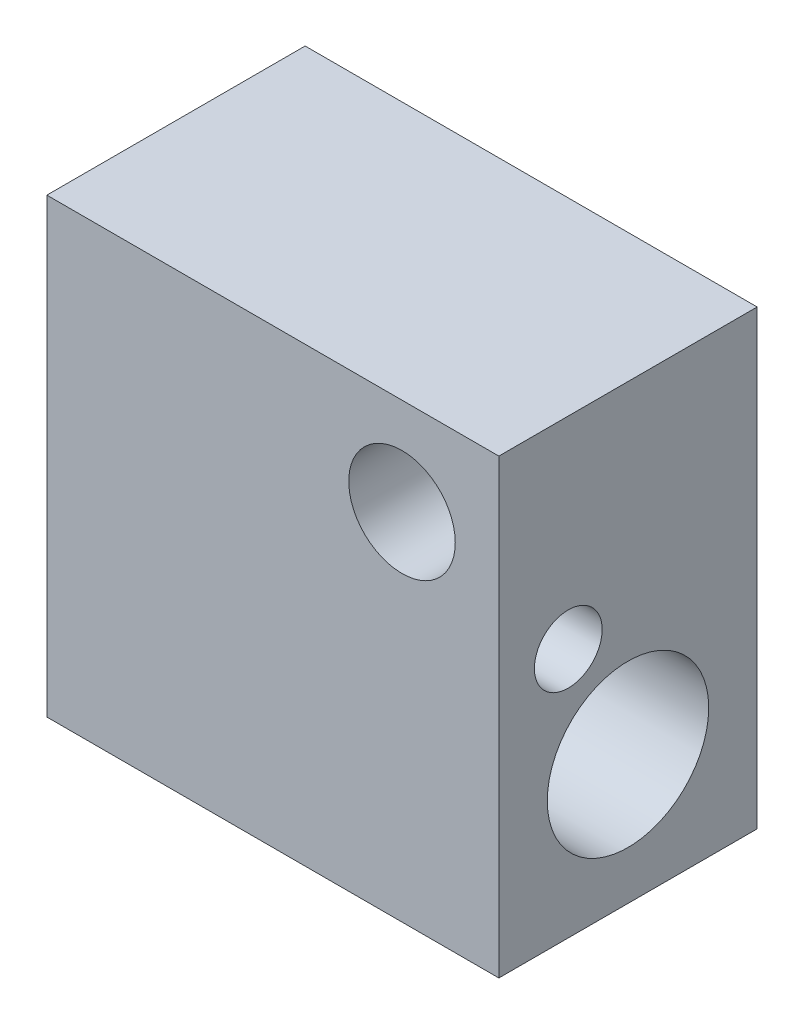
ISO-10303-21;
HEADER;
FILE_DESCRIPTION(('STEP AP214'),'2;1');
FILE_NAME('part.step','',(''),(''),'','','');
FILE_SCHEMA(('AUTOMOTIVE_DESIGN { 1 0 10303 214 1 1 1 1 }'));
ENDSEC;
DATA;
#1=APPLICATION_CONTEXT('core data for automotive mechanical design processes');
#2=APPLICATION_PROTOCOL_DEFINITION('international standard','automotive_design',2000,#1);
#3=PRODUCT_CONTEXT('',#1,'mechanical');
#4=PRODUCT('Part','Part','',(#3));
#5=PRODUCT_RELATED_PRODUCT_CATEGORY('part','',(#4));
#6=PRODUCT_DEFINITION_FORMATION('','',#4);
#7=PRODUCT_DEFINITION_CONTEXT('part definition',#1,'design');
#8=PRODUCT_DEFINITION('design','',#6,#7);
#9=PRODUCT_DEFINITION_SHAPE('','',#8);
#10=(LENGTH_UNIT() NAMED_UNIT(*) SI_UNIT(.MILLI.,.METRE.));
#11=(NAMED_UNIT(*) PLANE_ANGLE_UNIT() SI_UNIT($,.RADIAN.));
#12=(NAMED_UNIT(*) SI_UNIT($,.STERADIAN.) SOLID_ANGLE_UNIT());
#13=UNCERTAINTY_MEASURE_WITH_UNIT(LENGTH_MEASURE(1.E-05),#10,'distance_accuracy_value','');
#14=(GEOMETRIC_REPRESENTATION_CONTEXT(3) GLOBAL_UNCERTAINTY_ASSIGNED_CONTEXT((#13)) GLOBAL_UNIT_ASSIGNED_CONTEXT((#10,
#11,#12)) REPRESENTATION_CONTEXT('',''));
#15=CARTESIAN_POINT('',(0.,0.,0.));
#16=DIRECTION('',(0.,0.,1.));
#17=DIRECTION('',(1.,0.,0.));
#18=AXIS2_PLACEMENT_3D('',#15,#16,#17);
#19=CARTESIAN_POINT('',(0.,0.,8.));
#20=DIRECTION('',(1.,0.,0.));
#21=DIRECTION('',(0.,0.,-1.));
#22=AXIS2_PLACEMENT_3D('',#19,#20,#21);
#23=PLANE('',#22);
#24=CARTESIAN_POINT('',(0.,7.75,5.85));
#25=DIRECTION('',(-1.,0.,0.));
#26=DIRECTION('',(0.,0.,1.));
#27=AXIS2_PLACEMENT_3D('',#24,#25,#26);
#28=CIRCLE('',#27,1.05);
#29=CARTESIAN_POINT('',(0.,7.75,6.9));
#30=VERTEX_POINT('',#29);
#31=EDGE_CURVE('E126',#30,#30,#28,.T.);
#32=ORIENTED_EDGE('',*,*,#31,.F.);
#33=EDGE_LOOP('',(#32));
#34=FACE_BOUND('',#33,.T.);
#35=CARTESIAN_POINT('',(0.,4.,4.));
#36=DIRECTION('',(-1.,0.,0.));
#37=DIRECTION('',(0.,0.,1.));
#38=AXIS2_PLACEMENT_3D('',#35,#36,#37);
#39=CIRCLE('',#38,2.49999999999999);
#40=CARTESIAN_POINT('',(0.,4.,6.49999999999999));
#41=VERTEX_POINT('',#40);
#42=EDGE_CURVE('E120',#41,#41,#39,.T.);
#43=ORIENTED_EDGE('',*,*,#42,.F.);
#44=EDGE_LOOP('',(#43));
#45=FACE_BOUND('',#44,.T.);
#46=DIRECTION('',(0.,-1.,0.));
#47=VECTOR('',#46,1.);
#48=CARTESIAN_POINT('',(0.,0.,0.));
#49=LINE('',#48,#47);
#50=CARTESIAN_POINT('',(0.,14.,0.));
#51=VERTEX_POINT('',#50);
#52=CARTESIAN_POINT('',(0.,0.,0.));
#53=VERTEX_POINT('',#52);
#54=EDGE_CURVE('E101',#51,#53,#49,.T.);
#55=ORIENTED_EDGE('',*,*,#54,.T.);
#56=DIRECTION('',(0.,0.,-1.));
#57=VECTOR('',#56,1.);
#58=CARTESIAN_POINT('',(0.,0.,8.));
#59=LINE('',#58,#57);
#60=CARTESIAN_POINT('',(0.,0.,8.));
#61=VERTEX_POINT('',#60);
#62=EDGE_CURVE('E11',#61,#53,#59,.T.);
#63=ORIENTED_EDGE('',*,*,#62,.F.);
#64=DIRECTION('',(0.,-1.,0.));
#65=VECTOR('',#64,1.);
#66=CARTESIAN_POINT('',(0.,0.,8.));
#67=LINE('',#66,#65);
#68=CARTESIAN_POINT('',(0.,14.,8.));
#69=VERTEX_POINT('',#68);
#70=EDGE_CURVE('E88',#69,#61,#67,.T.);
#71=ORIENTED_EDGE('',*,*,#70,.F.);
#72=DIRECTION('',(0.,0.,-1.));
#73=VECTOR('',#72,1.);
#74=CARTESIAN_POINT('',(0.,14.,8.));
#75=LINE('',#74,#73);
#76=EDGE_CURVE('E97',#69,#51,#75,.T.);
#77=ORIENTED_EDGE('',*,*,#76,.T.);
#78=EDGE_LOOP('',(#55,#63,#71,#77));
#79=FACE_BOUND('',#78,.T.);
#80=ADVANCED_FACE('F36',(#34,#45,#79),#23,.F.);
#81=CARTESIAN_POINT('',(0.,0.,8.));
#82=DIRECTION('',(0.,1.,0.));
#83=DIRECTION('',(0.,0.,1.));
#84=AXIS2_PLACEMENT_3D('',#81,#82,#83);
#85=PLANE('',#84);
#86=DIRECTION('',(1.,0.,0.));
#87=VECTOR('',#86,1.);
#88=CARTESIAN_POINT('',(0.,0.,0.));
#89=LINE('',#88,#87);
#90=CARTESIAN_POINT('',(14.,0.,0.));
#91=VERTEX_POINT('',#90);
#92=EDGE_CURVE('E92',#53,#91,#89,.T.);
#93=ORIENTED_EDGE('',*,*,#92,.T.);
#94=DIRECTION('',(0.,0.,-1.));
#95=VECTOR('',#94,1.);
#96=CARTESIAN_POINT('',(14.,0.,8.));
#97=LINE('',#96,#95);
#98=CARTESIAN_POINT('',(14.,0.,8.));
#99=VERTEX_POINT('',#98);
#100=EDGE_CURVE('E45',#99,#91,#97,.T.);
#101=ORIENTED_EDGE('',*,*,#100,.F.);
#102=DIRECTION('',(1.,0.,0.));
#103=VECTOR('',#102,1.);
#104=CARTESIAN_POINT('',(0.,0.,8.));
#105=LINE('',#104,#103);
#106=EDGE_CURVE('E83',#61,#99,#105,.T.);
#107=ORIENTED_EDGE('',*,*,#106,.F.);
#108=ORIENTED_EDGE('',*,*,#62,.T.);
#109=EDGE_LOOP('',(#93,#101,#107,#108));
#110=FACE_BOUND('',#109,.T.);
#111=ADVANCED_FACE('F91',(#110),#85,.F.);
#112=CARTESIAN_POINT('',(14.,0.,8.));
#113=DIRECTION('',(-1.,0.,0.));
#114=DIRECTION('',(0.,0.,1.));
#115=AXIS2_PLACEMENT_3D('',#112,#113,#114);
#116=PLANE('',#115);
#117=CARTESIAN_POINT('',(14.,7.75,5.85));
#118=DIRECTION('',(-1.,0.,0.));
#119=DIRECTION('',(0.,0.,1.));
#120=AXIS2_PLACEMENT_3D('',#117,#118,#119);
#121=CIRCLE('',#120,1.05);
#122=CARTESIAN_POINT('',(14.,7.75,6.9));
#123=VERTEX_POINT('',#122);
#124=EDGE_CURVE('E123',#123,#123,#121,.T.);
#125=ORIENTED_EDGE('',*,*,#124,.T.);
#126=EDGE_LOOP('',(#125));
#127=FACE_BOUND('',#126,.T.);
#128=CARTESIAN_POINT('',(14.,4.,4.));
#129=DIRECTION('',(-1.,0.,0.));
#130=DIRECTION('',(0.,0.,1.));
#131=AXIS2_PLACEMENT_3D('',#128,#129,#130);
#132=CIRCLE('',#131,2.5);
#133=CARTESIAN_POINT('',(14.,4.,6.5));
#134=VERTEX_POINT('',#133);
#135=EDGE_CURVE('E117',#134,#134,#132,.T.);
#136=ORIENTED_EDGE('',*,*,#135,.T.);
#137=EDGE_LOOP('',(#136));
#138=FACE_BOUND('',#137,.T.);
#139=DIRECTION('',(0.,1.,0.));
#140=VECTOR('',#139,1.);
#141=CARTESIAN_POINT('',(14.,0.,0.));
#142=LINE('',#141,#140);
#143=CARTESIAN_POINT('',(14.,14.,0.));
#144=VERTEX_POINT('',#143);
#145=EDGE_CURVE('E70',#91,#144,#142,.T.);
#146=ORIENTED_EDGE('',*,*,#145,.T.);
#147=DIRECTION('',(0.,0.,-1.));
#148=VECTOR('',#147,1.);
#149=CARTESIAN_POINT('',(14.,14.,8.));
#150=LINE('',#149,#148);
#151=CARTESIAN_POINT('',(14.,14.,8.));
#152=VERTEX_POINT('',#151);
#153=EDGE_CURVE('E93',#152,#144,#150,.T.);
#154=ORIENTED_EDGE('',*,*,#153,.F.);
#155=DIRECTION('',(0.,1.,0.));
#156=VECTOR('',#155,1.);
#157=CARTESIAN_POINT('',(14.,0.,8.));
#158=LINE('',#157,#156);
#159=EDGE_CURVE('E86',#99,#152,#158,.T.);
#160=ORIENTED_EDGE('',*,*,#159,.F.);
#161=ORIENTED_EDGE('',*,*,#100,.T.);
#162=EDGE_LOOP('',(#146,#154,#160,#161));
#163=FACE_BOUND('',#162,.T.);
#164=ADVANCED_FACE('F95',(#127,#138,#163),#116,.F.);
#165=CARTESIAN_POINT('',(0.,14.,8.));
#166=DIRECTION('',(0.,-1.,0.));
#167=DIRECTION('',(0.,0.,-1.));
#168=AXIS2_PLACEMENT_3D('',#165,#166,#167);
#169=PLANE('',#168);
#170=DIRECTION('',(-1.,0.,0.));
#171=VECTOR('',#170,1.);
#172=CARTESIAN_POINT('',(0.,14.,0.));
#173=LINE('',#172,#171);
#174=EDGE_CURVE('E76',#144,#51,#173,.T.);
#175=ORIENTED_EDGE('',*,*,#174,.T.);
#176=ORIENTED_EDGE('',*,*,#76,.F.);
#177=DIRECTION('',(-1.,0.,0.));
#178=VECTOR('',#177,1.);
#179=CARTESIAN_POINT('',(0.,14.,8.));
#180=LINE('',#179,#178);
#181=EDGE_CURVE('E53',#152,#69,#180,.T.);
#182=ORIENTED_EDGE('',*,*,#181,.F.);
#183=ORIENTED_EDGE('',*,*,#153,.T.);
#184=EDGE_LOOP('',(#175,#176,#182,#183));
#185=FACE_BOUND('',#184,.T.);
#186=ADVANCED_FACE('F109',(#185),#169,.F.);
#187=CARTESIAN_POINT('',(0.,14.,8.));
#188=DIRECTION('',(0.,0.,-1.));
#189=DIRECTION('',(-1.,0.,0.));
#190=AXIS2_PLACEMENT_3D('',#187,#188,#189);
#191=PLANE('',#190);
#192=CARTESIAN_POINT('',(11.,11.,8.));
#193=DIRECTION('',(0.,0.,1.));
#194=DIRECTION('',(1.,0.,0.));
#195=AXIS2_PLACEMENT_3D('',#192,#193,#194);
#196=CIRCLE('',#195,1.64999999999999);
#197=CARTESIAN_POINT('',(12.65,11.,8.));
#198=VERTEX_POINT('',#197);
#199=EDGE_CURVE('E104',#198,#198,#196,.T.);
#200=ORIENTED_EDGE('',*,*,#199,.F.);
#201=EDGE_LOOP('',(#200));
#202=FACE_BOUND('',#201,.T.);
#203=ORIENTED_EDGE('',*,*,#70,.T.);
#204=ORIENTED_EDGE('',*,*,#106,.T.);
#205=ORIENTED_EDGE('',*,*,#159,.T.);
#206=ORIENTED_EDGE('',*,*,#181,.T.);
#207=EDGE_LOOP('',(#203,#204,#205,#206));
#208=FACE_BOUND('',#207,.T.);
#209=ADVANCED_FACE('F84',(#202,#208),#191,.F.);
#210=CARTESIAN_POINT('',(0.,14.,0.));
#211=DIRECTION('',(0.,0.,-1.));
#212=DIRECTION('',(-1.,0.,0.));
#213=AXIS2_PLACEMENT_3D('',#210,#211,#212);
#214=PLANE('',#213);
#215=CARTESIAN_POINT('',(11.,11.,0.));
#216=DIRECTION('',(0.,0.,-1.));
#217=DIRECTION('',(-1.,0.,0.));
#218=AXIS2_PLACEMENT_3D('',#215,#216,#217);
#219=CIRCLE('',#218,2.);
#220=CARTESIAN_POINT('',(9.,11.,0.));
#221=VERTEX_POINT('',#220);
#222=EDGE_CURVE('E132',#221,#221,#219,.T.);
#223=ORIENTED_EDGE('',*,*,#222,.F.);
#224=EDGE_LOOP('',(#223));
#225=FACE_BOUND('',#224,.T.);
#226=ORIENTED_EDGE('',*,*,#54,.F.);
#227=ORIENTED_EDGE('',*,*,#174,.F.);
#228=ORIENTED_EDGE('',*,*,#145,.F.);
#229=ORIENTED_EDGE('',*,*,#92,.F.);
#230=EDGE_LOOP('',(#226,#227,#228,#229));
#231=FACE_BOUND('',#230,.T.);
#232=ADVANCED_FACE('F112',(#225,#231),#214,.T.);
#233=CARTESIAN_POINT('',(11.,11.,8.));
#234=DIRECTION('',(0.,0.,1.));
#235=DIRECTION('',(1.,0.,0.));
#236=AXIS2_PLACEMENT_3D('',#233,#234,#235);
#237=CYLINDRICAL_SURFACE('',#236,1.64999999999999);
#238=CARTESIAN_POINT('',(11.,11.,1.21030121665965));
#239=DIRECTION('',(0.,0.,-1.));
#240=DIRECTION('',(-1.,0.,0.));
#241=AXIS2_PLACEMENT_3D('',#238,#239,#240);
#242=CIRCLE('',#241,1.64999999999999);
#243=CARTESIAN_POINT('',(9.35000000000001,11.,1.21030121665965));
#244=VERTEX_POINT('',#243);
#245=EDGE_CURVE('E39',#244,#244,#242,.T.);
#246=ORIENTED_EDGE('',*,*,#245,.T.);
#247=EDGE_LOOP('',(#246));
#248=FACE_BOUND('',#247,.T.);
#249=ORIENTED_EDGE('',*,*,#199,.T.);
#250=EDGE_LOOP('',(#249));
#251=FACE_BOUND('',#250,.T.);
#252=ADVANCED_FACE('F139',(#248,#251),#237,.F.);
#253=CARTESIAN_POINT('',(0.,4.,4.));
#254=DIRECTION('',(-1.,0.,0.));
#255=DIRECTION('',(0.,0.,1.));
#256=AXIS2_PLACEMENT_3D('',#253,#254,#255);
#257=CYLINDRICAL_SURFACE('',#256,2.49999999999999);
#258=ORIENTED_EDGE('',*,*,#135,.F.);
#259=EDGE_LOOP('',(#258));
#260=FACE_BOUND('',#259,.T.);
#261=ORIENTED_EDGE('',*,*,#42,.T.);
#262=EDGE_LOOP('',(#261));
#263=FACE_BOUND('',#262,.T.);
#264=ADVANCED_FACE('F145',(#260,#263),#257,.F.);
#265=CARTESIAN_POINT('',(0.,7.75,5.85));
#266=DIRECTION('',(-1.,0.,0.));
#267=DIRECTION('',(0.,0.,1.));
#268=AXIS2_PLACEMENT_3D('',#265,#266,#267);
#269=CYLINDRICAL_SURFACE('',#268,1.05);
#270=ORIENTED_EDGE('',*,*,#124,.F.);
#271=EDGE_LOOP('',(#270));
#272=FACE_BOUND('',#271,.T.);
#273=ORIENTED_EDGE('',*,*,#31,.T.);
#274=EDGE_LOOP('',(#273));
#275=FACE_BOUND('',#274,.T.);
#276=ADVANCED_FACE('F161',(#272,#275),#269,.F.);
#277=CARTESIAN_POINT('',(11.,11.,1.));
#278=DIRECTION('',(0.,0.,-1.));
#279=DIRECTION('',(-1.,0.,0.));
#280=AXIS2_PLACEMENT_3D('',#277,#278,#279);
#281=CONICAL_SURFACE('',#280,2.,1.02974425867665);
#282=CARTESIAN_POINT('',(11.,11.,1.));
#283=DIRECTION('',(0.,0.,-1.));
#284=DIRECTION('',(-1.,0.,0.));
#285=AXIS2_PLACEMENT_3D('',#282,#283,#284);
#286=CIRCLE('',#285,2.);
#287=CARTESIAN_POINT('',(9.,11.,1.));
#288=VERTEX_POINT('',#287);
#289=EDGE_CURVE('E129',#288,#288,#286,.T.);
#290=ORIENTED_EDGE('',*,*,#289,.T.);
#291=EDGE_LOOP('',(#290));
#292=FACE_BOUND('',#291,.T.);
#293=ORIENTED_EDGE('',*,*,#245,.F.);
#294=EDGE_LOOP('',(#293));
#295=FACE_BOUND('',#294,.T.);
#296=ADVANCED_FACE('F167',(#292,#295),#281,.F.);
#297=CARTESIAN_POINT('',(11.,11.,0.));
#298=DIRECTION('',(0.,0.,-1.));
#299=DIRECTION('',(-1.,0.,0.));
#300=AXIS2_PLACEMENT_3D('',#297,#298,#299);
#301=CYLINDRICAL_SURFACE('',#300,2.);
#302=ORIENTED_EDGE('',*,*,#289,.F.);
#303=EDGE_LOOP('',(#302));
#304=FACE_BOUND('',#303,.T.);
#305=ORIENTED_EDGE('',*,*,#222,.T.);
#306=EDGE_LOOP('',(#305));
#307=FACE_BOUND('',#306,.T.);
#308=ADVANCED_FACE('F136',(#304,#307),#301,.F.);
#309=CLOSED_SHELL('',(#80,#111,#164,#186,#209,#232,#252,#264,#276,#296,#308));
#310=MANIFOLD_SOLID_BREP('B2',#309);
#311=ADVANCED_BREP_SHAPE_REPRESENTATION('',(#18,#310),#14);
#312=SHAPE_DEFINITION_REPRESENTATION(#9,#311);
ENDSEC;
END-ISO-10303-21;
